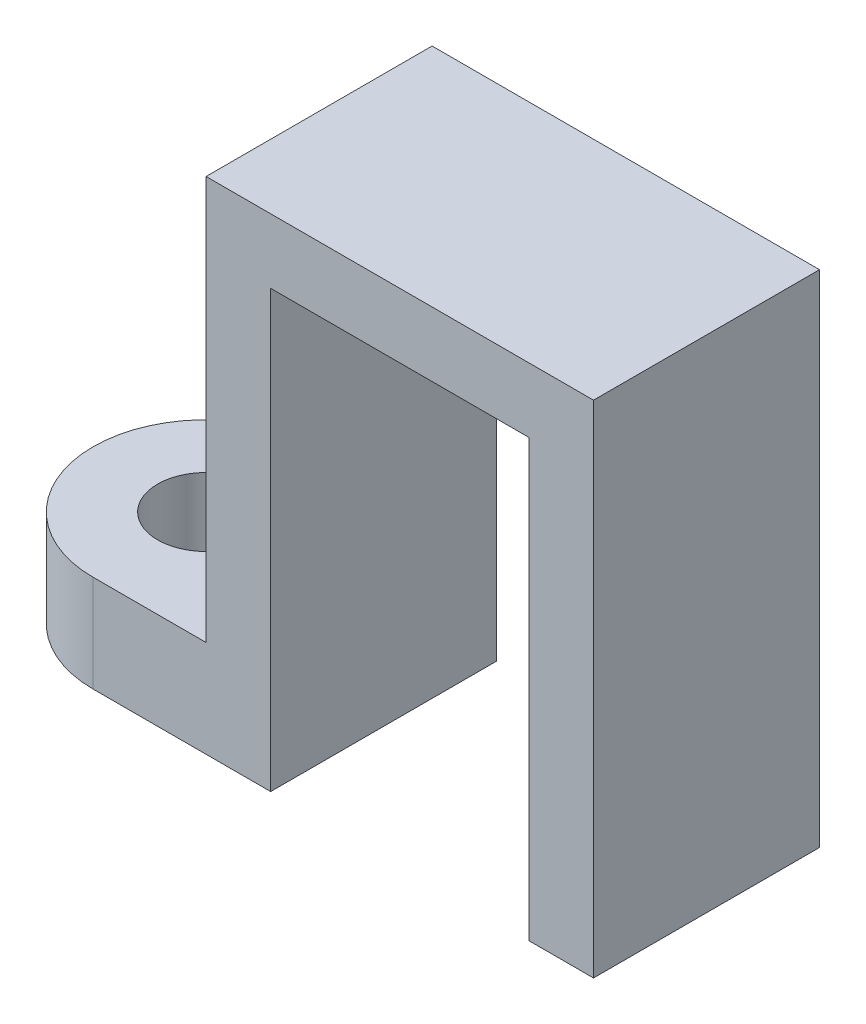
ISO-10303-21;
HEADER;
FILE_DESCRIPTION(('STEP AP214'),'2;1');
FILE_NAME('part.step','',(''),(''),'','','');
FILE_SCHEMA(('AUTOMOTIVE_DESIGN { 1 0 10303 214 1 1 1 1 }'));
ENDSEC;
DATA;
#1=APPLICATION_CONTEXT('core data for automotive mechanical design processes');
#2=APPLICATION_PROTOCOL_DEFINITION('international standard','automotive_design',2000,#1);
#3=PRODUCT_CONTEXT('',#1,'mechanical');
#4=PRODUCT('Part','Part','',(#3));
#5=PRODUCT_RELATED_PRODUCT_CATEGORY('part','',(#4));
#6=PRODUCT_DEFINITION_FORMATION('','',#4);
#7=PRODUCT_DEFINITION_CONTEXT('part definition',#1,'design');
#8=PRODUCT_DEFINITION('design','',#6,#7);
#9=PRODUCT_DEFINITION_SHAPE('','',#8);
#10=(LENGTH_UNIT() NAMED_UNIT(*) SI_UNIT(.MILLI.,.METRE.));
#11=(NAMED_UNIT(*) PLANE_ANGLE_UNIT() SI_UNIT($,.RADIAN.));
#12=(NAMED_UNIT(*) SI_UNIT($,.STERADIAN.) SOLID_ANGLE_UNIT());
#13=UNCERTAINTY_MEASURE_WITH_UNIT(LENGTH_MEASURE(1.E-05),#10,'distance_accuracy_value','');
#14=(GEOMETRIC_REPRESENTATION_CONTEXT(3) GLOBAL_UNCERTAINTY_ASSIGNED_CONTEXT((#13)) GLOBAL_UNIT_ASSIGNED_CONTEXT((#10,
#11,#12)) REPRESENTATION_CONTEXT('',''));
#15=CARTESIAN_POINT('',(0.,0.,0.));
#16=DIRECTION('',(0.,0.,1.));
#17=DIRECTION('',(1.,0.,0.));
#18=AXIS2_PLACEMENT_3D('',#15,#16,#17);
#19=CARTESIAN_POINT('',(-5.5,3.,3.5));
#20=DIRECTION('',(0.,1.,0.));
#21=DIRECTION('',(0.,0.,1.));
#22=AXIS2_PLACEMENT_3D('',#19,#20,#21);
#23=CYLINDRICAL_SURFACE('',#22,3.5);
#24=DIRECTION('',(0.,1.,0.));
#25=VECTOR('',#24,1.);
#26=CARTESIAN_POINT('',(-5.5,0.,7.));
#27=LINE('',#26,#25);
#28=CARTESIAN_POINT('',(-5.5,3.,7.));
#29=VERTEX_POINT('',#28);
#30=CARTESIAN_POINT('',(-5.5,0.,7.));
#31=VERTEX_POINT('',#30);
#32=EDGE_CURVE('E195',#29,#31,#27,.F.);
#33=ORIENTED_EDGE('',*,*,#32,.F.);
#34=CARTESIAN_POINT('',(-5.5,3.,3.5));
#35=DIRECTION('',(0.,-1.,0.));
#36=DIRECTION('',(1.,0.,0.));
#37=AXIS2_PLACEMENT_3D('',#34,#35,#36);
#38=CIRCLE('',#37,3.5);
#39=CARTESIAN_POINT('',(-5.5,3.,0.));
#40=VERTEX_POINT('',#39);
#41=EDGE_CURVE('E45',#40,#29,#38,.F.);
#42=ORIENTED_EDGE('',*,*,#41,.F.);
#43=DIRECTION('',(0.,-1.,0.));
#44=VECTOR('',#43,1.);
#45=CARTESIAN_POINT('',(-5.5,3.,0.));
#46=LINE('',#45,#44);
#47=CARTESIAN_POINT('',(-5.5,0.,0.));
#48=VERTEX_POINT('',#47);
#49=EDGE_CURVE('E198',#48,#40,#46,.F.);
#50=ORIENTED_EDGE('',*,*,#49,.F.);
#51=CARTESIAN_POINT('',(-5.5,0.,3.5));
#52=DIRECTION('',(0.,-1.,0.));
#53=DIRECTION('',(0.,0.,-1.));
#54=AXIS2_PLACEMENT_3D('',#51,#52,#53);
#55=CIRCLE('',#54,3.5);
#56=EDGE_CURVE('E11',#31,#48,#55,.T.);
#57=ORIENTED_EDGE('',*,*,#56,.F.);
#58=EDGE_LOOP('',(#33,#42,#50,#57));
#59=FACE_BOUND('',#58,.T.);
#60=ADVANCED_FACE('F37',(#59),#23,.T.);
#61=CARTESIAN_POINT('',(8.00000000000001,0.,7.));
#62=DIRECTION('',(-1.,0.,0.));
#63=DIRECTION('',(0.,-1.,0.));
#64=AXIS2_PLACEMENT_3D('',#61,#62,#63);
#65=PLANE('',#64);
#66=DIRECTION('',(0.,1.,0.));
#67=VECTOR('',#66,1.);
#68=CARTESIAN_POINT('',(8.00000000000001,0.,0.));
#69=LINE('',#68,#67);
#70=CARTESIAN_POINT('',(8.00000000000001,0.,0.));
#71=VERTEX_POINT('',#70);
#72=CARTESIAN_POINT('',(8.,13.5,0.));
#73=VERTEX_POINT('',#72);
#74=EDGE_CURVE('E118',#71,#73,#69,.T.);
#75=ORIENTED_EDGE('',*,*,#74,.F.);
#76=DIRECTION('',(0.,0.,-1.));
#77=VECTOR('',#76,1.);
#78=CARTESIAN_POINT('',(8.00000000000001,0.,7.));
#79=LINE('',#78,#77);
#80=CARTESIAN_POINT('',(8.00000000000001,0.,7.));
#81=VERTEX_POINT('',#80);
#82=EDGE_CURVE('E112',#81,#71,#79,.T.);
#83=ORIENTED_EDGE('',*,*,#82,.F.);
#84=DIRECTION('',(0.,1.,0.));
#85=VECTOR('',#84,1.);
#86=CARTESIAN_POINT('',(8.00000000000001,0.,7.));
#87=LINE('',#86,#85);
#88=CARTESIAN_POINT('',(8.,13.5,7.));
#89=VERTEX_POINT('',#88);
#90=EDGE_CURVE('E116',#81,#89,#87,.T.);
#91=ORIENTED_EDGE('',*,*,#90,.T.);
#92=DIRECTION('',(0.,0.,-1.));
#93=VECTOR('',#92,1.);
#94=CARTESIAN_POINT('',(8.,13.5,7.));
#95=LINE('',#94,#93);
#96=EDGE_CURVE('E160',#89,#73,#95,.T.);
#97=ORIENTED_EDGE('',*,*,#96,.T.);
#98=EDGE_LOOP('',(#75,#83,#91,#97));
#99=FACE_BOUND('',#98,.T.);
#100=ADVANCED_FACE('F114',(#99),#65,.T.);
#101=CARTESIAN_POINT('',(0.,0.,7.));
#102=DIRECTION('',(0.,1.,0.));
#103=DIRECTION('',(-1.,0.,0.));
#104=AXIS2_PLACEMENT_3D('',#101,#102,#103);
#105=PLANE('',#104);
#106=DIRECTION('',(1.,0.,0.));
#107=VECTOR('',#106,1.);
#108=CARTESIAN_POINT('',(0.,0.,0.));
#109=LINE('',#108,#107);
#110=CARTESIAN_POINT('',(10.,0.,0.));
#111=VERTEX_POINT('',#110);
#112=EDGE_CURVE('E162',#71,#111,#109,.T.);
#113=ORIENTED_EDGE('',*,*,#112,.T.);
#114=DIRECTION('',(0.,0.,-1.));
#115=VECTOR('',#114,1.);
#116=CARTESIAN_POINT('',(10.,0.,7.));
#117=LINE('',#116,#115);
#118=CARTESIAN_POINT('',(10.,0.,7.));
#119=VERTEX_POINT('',#118);
#120=EDGE_CURVE('E122',#119,#111,#117,.T.);
#121=ORIENTED_EDGE('',*,*,#120,.F.);
#122=DIRECTION('',(1.,0.,0.));
#123=VECTOR('',#122,1.);
#124=CARTESIAN_POINT('',(0.,0.,7.));
#125=LINE('',#124,#123);
#126=EDGE_CURVE('E125',#81,#119,#125,.T.);
#127=ORIENTED_EDGE('',*,*,#126,.F.);
#128=ORIENTED_EDGE('',*,*,#82,.T.);
#129=EDGE_LOOP('',(#113,#121,#127,#128));
#130=FACE_BOUND('',#129,.T.);
#131=ADVANCED_FACE('F126',(#130),#105,.F.);
#132=CARTESIAN_POINT('',(10.,0.,7.));
#133=DIRECTION('',(-1.,0.,0.));
#134=DIRECTION('',(0.,-1.,0.));
#135=AXIS2_PLACEMENT_3D('',#132,#133,#134);
#136=PLANE('',#135);
#137=DIRECTION('',(0.,1.,0.));
#138=VECTOR('',#137,1.);
#139=CARTESIAN_POINT('',(10.,0.,0.));
#140=LINE('',#139,#138);
#141=CARTESIAN_POINT('',(10.,15.5,0.));
#142=VERTEX_POINT('',#141);
#143=EDGE_CURVE('E164',#111,#142,#140,.T.);
#144=ORIENTED_EDGE('',*,*,#143,.T.);
#145=DIRECTION('',(0.,0.,-1.));
#146=VECTOR('',#145,1.);
#147=CARTESIAN_POINT('',(10.,15.5,7.));
#148=LINE('',#147,#146);
#149=CARTESIAN_POINT('',(10.,15.5,7.));
#150=VERTEX_POINT('',#149);
#151=EDGE_CURVE('E190',#150,#142,#148,.T.);
#152=ORIENTED_EDGE('',*,*,#151,.F.);
#153=DIRECTION('',(0.,1.,0.));
#154=VECTOR('',#153,1.);
#155=CARTESIAN_POINT('',(10.,0.,7.));
#156=LINE('',#155,#154);
#157=EDGE_CURVE('E130',#119,#150,#156,.T.);
#158=ORIENTED_EDGE('',*,*,#157,.F.);
#159=ORIENTED_EDGE('',*,*,#120,.T.);
#160=EDGE_LOOP('',(#144,#152,#158,#159));
#161=FACE_BOUND('',#160,.T.);
#162=ADVANCED_FACE('F223',(#161),#136,.F.);
#163=CARTESIAN_POINT('',(0.,15.5,7.));
#164=DIRECTION('',(0.,1.,0.));
#165=DIRECTION('',(-1.,0.,0.));
#166=AXIS2_PLACEMENT_3D('',#163,#164,#165);
#167=PLANE('',#166);
#168=DIRECTION('',(1.,0.,0.));
#169=VECTOR('',#168,1.);
#170=CARTESIAN_POINT('',(0.,15.5,0.));
#171=LINE('',#170,#169);
#172=CARTESIAN_POINT('',(-2.,15.5,0.));
#173=VERTEX_POINT('',#172);
#174=EDGE_CURVE('E167',#173,#142,#171,.T.);
#175=ORIENTED_EDGE('',*,*,#174,.F.);
#176=DIRECTION('',(0.,0.,-1.));
#177=VECTOR('',#176,1.);
#178=CARTESIAN_POINT('',(-2.,15.5,7.));
#179=LINE('',#178,#177);
#180=CARTESIAN_POINT('',(-2.,15.5,7.));
#181=VERTEX_POINT('',#180);
#182=EDGE_CURVE('E188',#181,#173,#179,.T.);
#183=ORIENTED_EDGE('',*,*,#182,.F.);
#184=DIRECTION('',(1.,0.,0.));
#185=VECTOR('',#184,1.);
#186=CARTESIAN_POINT('',(0.,15.5,7.));
#187=LINE('',#186,#185);
#188=EDGE_CURVE('E147',#181,#150,#187,.T.);
#189=ORIENTED_EDGE('',*,*,#188,.T.);
#190=ORIENTED_EDGE('',*,*,#151,.T.);
#191=EDGE_LOOP('',(#175,#183,#189,#190));
#192=FACE_BOUND('',#191,.T.);
#193=ADVANCED_FACE('F226',(#192),#167,.T.);
#194=CARTESIAN_POINT('',(-2.,0.,7.));
#195=DIRECTION('',(-1.,0.,0.));
#196=DIRECTION('',(0.,0.,1.));
#197=AXIS2_PLACEMENT_3D('',#194,#195,#196);
#198=PLANE('',#197);
#199=DIRECTION('',(0.,1.,0.));
#200=VECTOR('',#199,1.);
#201=CARTESIAN_POINT('',(-2.,0.,0.));
#202=LINE('',#201,#200);
#203=CARTESIAN_POINT('',(-2.,3.,0.));
#204=VERTEX_POINT('',#203);
#205=EDGE_CURVE('E170',#204,#173,#202,.T.);
#206=ORIENTED_EDGE('',*,*,#205,.F.);
#207=DIRECTION('',(0.,0.,-1.));
#208=VECTOR('',#207,1.);
#209=CARTESIAN_POINT('',(-2.,3.,7.));
#210=LINE('',#209,#208);
#211=CARTESIAN_POINT('',(-2.,3.,7.));
#212=VERTEX_POINT('',#211);
#213=EDGE_CURVE('E186',#212,#204,#210,.T.);
#214=ORIENTED_EDGE('',*,*,#213,.F.);
#215=DIRECTION('',(0.,1.,0.));
#216=VECTOR('',#215,1.);
#217=CARTESIAN_POINT('',(-2.,0.,7.));
#218=LINE('',#217,#216);
#219=EDGE_CURVE('E150',#212,#181,#218,.T.);
#220=ORIENTED_EDGE('',*,*,#219,.T.);
#221=ORIENTED_EDGE('',*,*,#182,.T.);
#222=EDGE_LOOP('',(#206,#214,#220,#221));
#223=FACE_BOUND('',#222,.T.);
#224=ADVANCED_FACE('F208',(#223),#198,.T.);
#225=CARTESIAN_POINT('',(0.,3.,7.));
#226=DIRECTION('',(0.,-1.,0.));
#227=DIRECTION('',(1.,0.,0.));
#228=AXIS2_PLACEMENT_3D('',#225,#226,#227);
#229=PLANE('',#228);
#230=CARTESIAN_POINT('',(-5.5,3.,3.5));
#231=DIRECTION('',(0.,1.,0.));
#232=DIRECTION('',(-1.,0.,0.));
#233=AXIS2_PLACEMENT_3D('',#230,#231,#232);
#234=CIRCLE('',#233,1.5);
#235=CARTESIAN_POINT('',(-7.,3.,3.5));
#236=VERTEX_POINT('',#235);
#237=EDGE_CURVE('E361',#236,#236,#234,.T.);
#238=ORIENTED_EDGE('',*,*,#237,.F.);
#239=EDGE_LOOP('',(#238));
#240=FACE_BOUND('',#239,.T.);
#241=DIRECTION('',(-1.,0.,0.));
#242=VECTOR('',#241,1.);
#243=CARTESIAN_POINT('',(0.,3.,0.));
#244=LINE('',#243,#242);
#245=EDGE_CURVE('E173',#204,#40,#244,.T.);
#246=ORIENTED_EDGE('',*,*,#245,.T.);
#247=ORIENTED_EDGE('',*,*,#41,.T.);
#248=DIRECTION('',(-1.,0.,0.));
#249=VECTOR('',#248,1.);
#250=CARTESIAN_POINT('',(0.,3.,7.));
#251=LINE('',#250,#249);
#252=EDGE_CURVE('E153',#212,#29,#251,.T.);
#253=ORIENTED_EDGE('',*,*,#252,.F.);
#254=ORIENTED_EDGE('',*,*,#213,.T.);
#255=EDGE_LOOP('',(#246,#247,#253,#254));
#256=FACE_BOUND('',#255,.T.);
#257=ADVANCED_FACE('F201',(#240,#256),#229,.F.);
#258=CARTESIAN_POINT('',(0.,0.,7.));
#259=DIRECTION('',(0.,-1.,0.));
#260=DIRECTION('',(0.,0.,-1.));
#261=AXIS2_PLACEMENT_3D('',#258,#259,#260);
#262=PLANE('',#261);
#263=CARTESIAN_POINT('',(-5.5,0.,3.5));
#264=DIRECTION('',(0.,1.,0.));
#265=DIRECTION('',(-1.,0.,0.));
#266=AXIS2_PLACEMENT_3D('',#263,#264,#265);
#267=CIRCLE('',#266,1.5);
#268=CARTESIAN_POINT('',(-7.,0.,3.5));
#269=VERTEX_POINT('',#268);
#270=EDGE_CURVE('E360',#269,#269,#267,.T.);
#271=ORIENTED_EDGE('',*,*,#270,.T.);
#272=EDGE_LOOP('',(#271));
#273=FACE_BOUND('',#272,.T.);
#274=DIRECTION('',(-1.,0.,0.));
#275=VECTOR('',#274,1.);
#276=CARTESIAN_POINT('',(0.,0.,7.));
#277=LINE('',#276,#275);
#278=CARTESIAN_POINT('',(0.,0.,7.));
#279=VERTEX_POINT('',#278);
#280=EDGE_CURVE('E155',#279,#31,#277,.T.);
#281=ORIENTED_EDGE('',*,*,#280,.T.);
#282=ORIENTED_EDGE('',*,*,#56,.T.);
#283=DIRECTION('',(-1.,0.,0.));
#284=VECTOR('',#283,1.);
#285=CARTESIAN_POINT('',(0.,0.,0.));
#286=LINE('',#285,#284);
#287=CARTESIAN_POINT('',(0.,0.,0.));
#288=VERTEX_POINT('',#287);
#289=EDGE_CURVE('E176',#288,#48,#286,.T.);
#290=ORIENTED_EDGE('',*,*,#289,.F.);
#291=DIRECTION('',(0.,0.,-1.));
#292=VECTOR('',#291,1.);
#293=CARTESIAN_POINT('',(0.,0.,7.));
#294=LINE('',#293,#292);
#295=EDGE_CURVE('E184',#279,#288,#294,.T.);
#296=ORIENTED_EDGE('',*,*,#295,.F.);
#297=EDGE_LOOP('',(#281,#282,#290,#296));
#298=FACE_BOUND('',#297,.T.);
#299=ADVANCED_FACE('F214',(#273,#298),#262,.T.);
#300=CARTESIAN_POINT('',(0.,0.,7.));
#301=DIRECTION('',(-1.,0.,0.));
#302=DIRECTION('',(0.,-1.,0.));
#303=AXIS2_PLACEMENT_3D('',#300,#301,#302);
#304=PLANE('',#303);
#305=DIRECTION('',(0.,1.,0.));
#306=VECTOR('',#305,1.);
#307=CARTESIAN_POINT('',(0.,0.,0.));
#308=LINE('',#307,#306);
#309=CARTESIAN_POINT('',(0.,13.5,0.));
#310=VERTEX_POINT('',#309);
#311=EDGE_CURVE('E140',#288,#310,#308,.T.);
#312=ORIENTED_EDGE('',*,*,#311,.T.);
#313=DIRECTION('',(0.,0.,-1.));
#314=VECTOR('',#313,1.);
#315=CARTESIAN_POINT('',(0.,13.5,7.));
#316=LINE('',#315,#314);
#317=CARTESIAN_POINT('',(0.,13.5,7.));
#318=VERTEX_POINT('',#317);
#319=EDGE_CURVE('E181',#318,#310,#316,.T.);
#320=ORIENTED_EDGE('',*,*,#319,.F.);
#321=DIRECTION('',(0.,1.,0.));
#322=VECTOR('',#321,1.);
#323=CARTESIAN_POINT('',(0.,0.,7.));
#324=LINE('',#323,#322);
#325=EDGE_CURVE('E157',#279,#318,#324,.T.);
#326=ORIENTED_EDGE('',*,*,#325,.F.);
#327=ORIENTED_EDGE('',*,*,#295,.T.);
#328=EDGE_LOOP('',(#312,#320,#326,#327));
#329=FACE_BOUND('',#328,.T.);
#330=ADVANCED_FACE('F218',(#329),#304,.F.);
#331=CARTESIAN_POINT('',(0.,13.5,7.));
#332=DIRECTION('',(0.,1.,0.));
#333=DIRECTION('',(-1.,0.,0.));
#334=AXIS2_PLACEMENT_3D('',#331,#332,#333);
#335=PLANE('',#334);
#336=CARTESIAN_POINT('',(4.,13.5,3.5));
#337=DIRECTION('',(0.,1.,0.));
#338=DIRECTION('',(-1.,0.,0.));
#339=AXIS2_PLACEMENT_3D('',#336,#337,#338);
#340=CIRCLE('',#339,1.25);
#341=CARTESIAN_POINT('',(2.75,13.5,3.5));
#342=VERTEX_POINT('',#341);
#343=EDGE_CURVE('E121',#342,#342,#340,.F.);
#344=ORIENTED_EDGE('',*,*,#343,.F.);
#345=EDGE_LOOP('',(#344));
#346=FACE_BOUND('',#345,.T.);
#347=DIRECTION('',(1.,0.,0.));
#348=VECTOR('',#347,1.);
#349=CARTESIAN_POINT('',(0.,13.5,0.));
#350=LINE('',#349,#348);
#351=EDGE_CURVE('E137',#310,#73,#350,.T.);
#352=ORIENTED_EDGE('',*,*,#351,.T.);
#353=ORIENTED_EDGE('',*,*,#96,.F.);
#354=DIRECTION('',(1.,0.,0.));
#355=VECTOR('',#354,1.);
#356=CARTESIAN_POINT('',(0.,13.5,7.));
#357=LINE('',#356,#355);
#358=EDGE_CURVE('E135',#318,#89,#357,.T.);
#359=ORIENTED_EDGE('',*,*,#358,.F.);
#360=ORIENTED_EDGE('',*,*,#319,.T.);
#361=EDGE_LOOP('',(#352,#353,#359,#360));
#362=FACE_BOUND('',#361,.T.);
#363=ADVANCED_FACE('F220',(#346,#362),#335,.F.);
#364=CARTESIAN_POINT('',(0.,0.,7.));
#365=DIRECTION('',(0.,0.,1.));
#366=DIRECTION('',(1.,0.,0.));
#367=AXIS2_PLACEMENT_3D('',#364,#365,#366);
#368=PLANE('',#367);
#369=ORIENTED_EDGE('',*,*,#252,.T.);
#370=ORIENTED_EDGE('',*,*,#32,.T.);
#371=ORIENTED_EDGE('',*,*,#280,.F.);
#372=ORIENTED_EDGE('',*,*,#325,.T.);
#373=ORIENTED_EDGE('',*,*,#358,.T.);
#374=ORIENTED_EDGE('',*,*,#90,.F.);
#375=ORIENTED_EDGE('',*,*,#126,.T.);
#376=ORIENTED_EDGE('',*,*,#157,.T.);
#377=ORIENTED_EDGE('',*,*,#188,.F.);
#378=ORIENTED_EDGE('',*,*,#219,.F.);
#379=EDGE_LOOP('',(#369,#370,#371,#372,#373,#374,#375,#376,#377,#378));
#380=FACE_BOUND('',#379,.T.);
#381=ADVANCED_FACE('F133',(#380),#368,.T.);
#382=CARTESIAN_POINT('',(0.,0.,0.));
#383=DIRECTION('',(0.,0.,1.));
#384=DIRECTION('',(1.,0.,0.));
#385=AXIS2_PLACEMENT_3D('',#382,#383,#384);
#386=PLANE('',#385);
#387=ORIENTED_EDGE('',*,*,#289,.T.);
#388=ORIENTED_EDGE('',*,*,#49,.T.);
#389=ORIENTED_EDGE('',*,*,#245,.F.);
#390=ORIENTED_EDGE('',*,*,#205,.T.);
#391=ORIENTED_EDGE('',*,*,#174,.T.);
#392=ORIENTED_EDGE('',*,*,#143,.F.);
#393=ORIENTED_EDGE('',*,*,#112,.F.);
#394=ORIENTED_EDGE('',*,*,#74,.T.);
#395=ORIENTED_EDGE('',*,*,#351,.F.);
#396=ORIENTED_EDGE('',*,*,#311,.F.);
#397=EDGE_LOOP('',(#387,#388,#389,#390,#391,#392,#393,#394,#395,#396));
#398=FACE_BOUND('',#397,.T.);
#399=ADVANCED_FACE('F211',(#398),#386,.F.);
#400=CARTESIAN_POINT('',(4.,12.5,3.5));
#401=DIRECTION('',(0.,1.,0.));
#402=DIRECTION('',(0.,0.,1.));
#403=AXIS2_PLACEMENT_3D('',#400,#401,#402);
#404=CYLINDRICAL_SURFACE('',#403,1.25);
#405=CARTESIAN_POINT('',(4.,12.5,3.5));
#406=DIRECTION('',(0.,-1.,0.));
#407=DIRECTION('',(0.,0.,-1.));
#408=AXIS2_PLACEMENT_3D('',#405,#406,#407);
#409=CIRCLE('',#408,1.25);
#410=CARTESIAN_POINT('',(4.,12.5,2.25));
#411=VERTEX_POINT('',#410);
#412=EDGE_CURVE('E143',#411,#411,#409,.T.);
#413=ORIENTED_EDGE('',*,*,#412,.F.);
#414=EDGE_LOOP('',(#413));
#415=FACE_BOUND('',#414,.T.);
#416=ORIENTED_EDGE('',*,*,#343,.T.);
#417=EDGE_LOOP('',(#416));
#418=FACE_BOUND('',#417,.T.);
#419=ADVANCED_FACE('F288',(#415,#418),#404,.T.);
#420=CARTESIAN_POINT('',(4.,12.5,3.5));
#421=DIRECTION('',(0.,-1.,0.));
#422=DIRECTION('',(0.,0.,-1.));
#423=AXIS2_PLACEMENT_3D('',#420,#421,#422);
#424=PLANE('',#423);
#425=ORIENTED_EDGE('',*,*,#412,.T.);
#426=EDGE_LOOP('',(#425));
#427=FACE_BOUND('',#426,.T.);
#428=ADVANCED_FACE('F293',(#427),#424,.T.);
#429=CARTESIAN_POINT('',(-5.5,0.,3.5));
#430=DIRECTION('',(0.,1.,0.));
#431=DIRECTION('',(-1.,0.,0.));
#432=AXIS2_PLACEMENT_3D('',#429,#430,#431);
#433=CYLINDRICAL_SURFACE('',#432,1.5);
#434=ORIENTED_EDGE('',*,*,#270,.F.);
#435=EDGE_LOOP('',(#434));
#436=FACE_BOUND('',#435,.T.);
#437=ORIENTED_EDGE('',*,*,#237,.T.);
#438=EDGE_LOOP('',(#437));
#439=FACE_BOUND('',#438,.T.);
#440=ADVANCED_FACE('F305',(#436,#439),#433,.F.);
#441=CLOSED_SHELL('',(#60,#100,#131,#162,#193,#224,#257,#299,#330,#363,#381,#399,#419,#428,#440));
#442=MANIFOLD_SOLID_BREP('B2',#441);
#443=ADVANCED_BREP_SHAPE_REPRESENTATION('',(#18,#442),#14);
#444=SHAPE_DEFINITION_REPRESENTATION(#9,#443);
ENDSEC;
END-ISO-10303-21;
